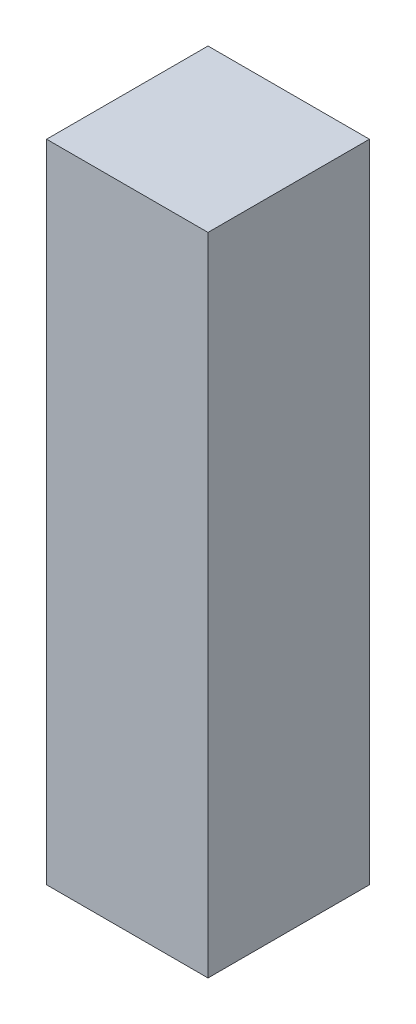
ISO-10303-21;
HEADER;
FILE_DESCRIPTION(('STEP AP214'),'2;1');
FILE_NAME('part.step','',(''),(''),'','','');
FILE_SCHEMA(('AUTOMOTIVE_DESIGN { 1 0 10303 214 1 1 1 1 }'));
ENDSEC;
DATA;
#1=APPLICATION_CONTEXT('core data for automotive mechanical design processes');
#2=APPLICATION_PROTOCOL_DEFINITION('international standard','automotive_design',2000,#1);
#3=PRODUCT_CONTEXT('',#1,'mechanical');
#4=PRODUCT('Part','Part','',(#3));
#5=PRODUCT_RELATED_PRODUCT_CATEGORY('part','',(#4));
#6=PRODUCT_DEFINITION_FORMATION('','',#4);
#7=PRODUCT_DEFINITION_CONTEXT('part definition',#1,'design');
#8=PRODUCT_DEFINITION('design','',#6,#7);
#9=PRODUCT_DEFINITION_SHAPE('','',#8);
#10=(LENGTH_UNIT() NAMED_UNIT(*) SI_UNIT(.MILLI.,.METRE.));
#11=(NAMED_UNIT(*) PLANE_ANGLE_UNIT() SI_UNIT($,.RADIAN.));
#12=(NAMED_UNIT(*) SI_UNIT($,.STERADIAN.) SOLID_ANGLE_UNIT());
#13=UNCERTAINTY_MEASURE_WITH_UNIT(LENGTH_MEASURE(1.E-05),#10,'distance_accuracy_value','');
#14=(GEOMETRIC_REPRESENTATION_CONTEXT(3) GLOBAL_UNCERTAINTY_ASSIGNED_CONTEXT((#13)) GLOBAL_UNIT_ASSIGNED_CONTEXT((#10,
#11,#12)) REPRESENTATION_CONTEXT('',''));
#15=CARTESIAN_POINT('',(0.,0.,0.));
#16=DIRECTION('',(0.,0.,1.));
#17=DIRECTION('',(1.,0.,0.));
#18=AXIS2_PLACEMENT_3D('',#15,#16,#17);
#19=CARTESIAN_POINT('',(1.25,10.,1.25));
#20=DIRECTION('',(-1.,0.,0.));
#21=DIRECTION('',(0.,0.,1.));
#22=AXIS2_PLACEMENT_3D('',#19,#20,#21);
#23=PLANE('',#22);
#24=DIRECTION('',(0.,0.,-1.));
#25=VECTOR('',#24,1.);
#26=CARTESIAN_POINT('',(1.25,0.,1.25));
#27=LINE('',#26,#25);
#28=CARTESIAN_POINT('',(1.25,0.,1.25));
#29=VERTEX_POINT('',#28);
#30=CARTESIAN_POINT('',(1.25,0.,-1.25));
#31=VERTEX_POINT('',#30);
#32=EDGE_CURVE('E107',#29,#31,#27,.T.);
#33=ORIENTED_EDGE('',*,*,#32,.T.);
#34=DIRECTION('',(0.,-1.,0.));
#35=VECTOR('',#34,1.);
#36=CARTESIAN_POINT('',(1.25,10.,-1.25));
#37=LINE('',#36,#35);
#38=CARTESIAN_POINT('',(1.25,10.,-1.25));
#39=VERTEX_POINT('',#38);
#40=EDGE_CURVE('E11',#39,#31,#37,.T.);
#41=ORIENTED_EDGE('',*,*,#40,.F.);
#42=DIRECTION('',(0.,0.,-1.));
#43=VECTOR('',#42,1.);
#44=CARTESIAN_POINT('',(1.25,10.,1.25));
#45=LINE('',#44,#43);
#46=CARTESIAN_POINT('',(1.25,10.,1.25));
#47=VERTEX_POINT('',#46);
#48=EDGE_CURVE('E91',#47,#39,#45,.T.);
#49=ORIENTED_EDGE('',*,*,#48,.F.);
#50=DIRECTION('',(0.,-1.,0.));
#51=VECTOR('',#50,1.);
#52=CARTESIAN_POINT('',(1.25,10.,1.25));
#53=LINE('',#52,#51);
#54=EDGE_CURVE('E103',#47,#29,#53,.T.);
#55=ORIENTED_EDGE('',*,*,#54,.T.);
#56=EDGE_LOOP('',(#33,#41,#49,#55));
#57=FACE_BOUND('',#56,.T.);
#58=ADVANCED_FACE('F39',(#57),#23,.F.);
#59=CARTESIAN_POINT('',(-1.25,10.,-1.25));
#60=DIRECTION('',(0.,0.,1.));
#61=DIRECTION('',(1.,0.,0.));
#62=AXIS2_PLACEMENT_3D('',#59,#60,#61);
#63=PLANE('',#62);
#64=DIRECTION('',(-1.,0.,0.));
#65=VECTOR('',#64,1.);
#66=CARTESIAN_POINT('',(-1.25,0.,-1.25));
#67=LINE('',#66,#65);
#68=CARTESIAN_POINT('',(-1.25,0.,-1.25));
#69=VERTEX_POINT('',#68);
#70=EDGE_CURVE('E96',#31,#69,#67,.T.);
#71=ORIENTED_EDGE('',*,*,#70,.T.);
#72=DIRECTION('',(0.,-1.,0.));
#73=VECTOR('',#72,1.);
#74=CARTESIAN_POINT('',(-1.25,10.,-1.25));
#75=LINE('',#74,#73);
#76=CARTESIAN_POINT('',(-1.25,10.,-1.25));
#77=VERTEX_POINT('',#76);
#78=EDGE_CURVE('E48',#77,#69,#75,.T.);
#79=ORIENTED_EDGE('',*,*,#78,.F.);
#80=DIRECTION('',(-1.,0.,0.));
#81=VECTOR('',#80,1.);
#82=CARTESIAN_POINT('',(-1.25,10.,-1.25));
#83=LINE('',#82,#81);
#84=EDGE_CURVE('E86',#39,#77,#83,.T.);
#85=ORIENTED_EDGE('',*,*,#84,.F.);
#86=ORIENTED_EDGE('',*,*,#40,.T.);
#87=EDGE_LOOP('',(#71,#79,#85,#86));
#88=FACE_BOUND('',#87,.T.);
#89=ADVANCED_FACE('F95',(#88),#63,.F.);
#90=CARTESIAN_POINT('',(-1.25,10.,1.25));
#91=DIRECTION('',(1.,0.,0.));
#92=DIRECTION('',(0.,0.,-1.));
#93=AXIS2_PLACEMENT_3D('',#90,#91,#92);
#94=PLANE('',#93);
#95=DIRECTION('',(0.,0.,1.));
#96=VECTOR('',#95,1.);
#97=CARTESIAN_POINT('',(-1.25,0.,1.25));
#98=LINE('',#97,#96);
#99=CARTESIAN_POINT('',(-1.25,0.,1.25));
#100=VERTEX_POINT('',#99);
#101=EDGE_CURVE('E73',#69,#100,#98,.T.);
#102=ORIENTED_EDGE('',*,*,#101,.T.);
#103=DIRECTION('',(0.,-1.,0.));
#104=VECTOR('',#103,1.);
#105=CARTESIAN_POINT('',(-1.25,10.,1.25));
#106=LINE('',#105,#104);
#107=CARTESIAN_POINT('',(-1.25,10.,1.25));
#108=VERTEX_POINT('',#107);
#109=EDGE_CURVE('E98',#108,#100,#106,.T.);
#110=ORIENTED_EDGE('',*,*,#109,.F.);
#111=DIRECTION('',(0.,0.,1.));
#112=VECTOR('',#111,1.);
#113=CARTESIAN_POINT('',(-1.25,10.,1.25));
#114=LINE('',#113,#112);
#115=EDGE_CURVE('E89',#77,#108,#114,.T.);
#116=ORIENTED_EDGE('',*,*,#115,.F.);
#117=ORIENTED_EDGE('',*,*,#78,.T.);
#118=EDGE_LOOP('',(#102,#110,#116,#117));
#119=FACE_BOUND('',#118,.T.);
#120=ADVANCED_FACE('F99',(#119),#94,.F.);
#121=CARTESIAN_POINT('',(-1.25,10.,1.25));
#122=DIRECTION('',(0.,0.,-1.));
#123=DIRECTION('',(-1.,0.,0.));
#124=AXIS2_PLACEMENT_3D('',#121,#122,#123);
#125=PLANE('',#124);
#126=DIRECTION('',(1.,0.,0.));
#127=VECTOR('',#126,1.);
#128=CARTESIAN_POINT('',(-1.25,0.,1.25));
#129=LINE('',#128,#127);
#130=EDGE_CURVE('E79',#100,#29,#129,.T.);
#131=ORIENTED_EDGE('',*,*,#130,.T.);
#132=ORIENTED_EDGE('',*,*,#54,.F.);
#133=DIRECTION('',(1.,0.,0.));
#134=VECTOR('',#133,1.);
#135=CARTESIAN_POINT('',(-1.25,10.,1.25));
#136=LINE('',#135,#134);
#137=EDGE_CURVE('E56',#108,#47,#136,.T.);
#138=ORIENTED_EDGE('',*,*,#137,.F.);
#139=ORIENTED_EDGE('',*,*,#109,.T.);
#140=EDGE_LOOP('',(#131,#132,#138,#139));
#141=FACE_BOUND('',#140,.T.);
#142=ADVANCED_FACE('F120',(#141),#125,.F.);
#143=CARTESIAN_POINT('',(0.,10.,0.));
#144=DIRECTION('',(0.,-1.,0.));
#145=DIRECTION('',(0.,0.,-1.));
#146=AXIS2_PLACEMENT_3D('',#143,#144,#145);
#147=PLANE('',#146);
#148=ORIENTED_EDGE('',*,*,#48,.T.);
#149=ORIENTED_EDGE('',*,*,#84,.T.);
#150=ORIENTED_EDGE('',*,*,#115,.T.);
#151=ORIENTED_EDGE('',*,*,#137,.T.);
#152=EDGE_LOOP('',(#148,#149,#150,#151));
#153=FACE_BOUND('',#152,.T.);
#154=ADVANCED_FACE('F87',(#153),#147,.F.);
#155=CARTESIAN_POINT('',(0.,0.,0.));
#156=DIRECTION('',(0.,-1.,0.));
#157=DIRECTION('',(0.,0.,-1.));
#158=AXIS2_PLACEMENT_3D('',#155,#156,#157);
#159=PLANE('',#158);
#160=ORIENTED_EDGE('',*,*,#32,.F.);
#161=ORIENTED_EDGE('',*,*,#130,.F.);
#162=ORIENTED_EDGE('',*,*,#101,.F.);
#163=ORIENTED_EDGE('',*,*,#70,.F.);
#164=EDGE_LOOP('',(#160,#161,#162,#163));
#165=FACE_BOUND('',#164,.T.);
#166=ADVANCED_FACE('F123',(#165),#159,.T.);
#167=CLOSED_SHELL('',(#58,#89,#120,#142,#154,#166));
#168=MANIFOLD_SOLID_BREP('B2',#167);
#169=ADVANCED_BREP_SHAPE_REPRESENTATION('',(#18,#168),#14);
#170=SHAPE_DEFINITION_REPRESENTATION(#9,#169);
ENDSEC;
END-ISO-10303-21;
